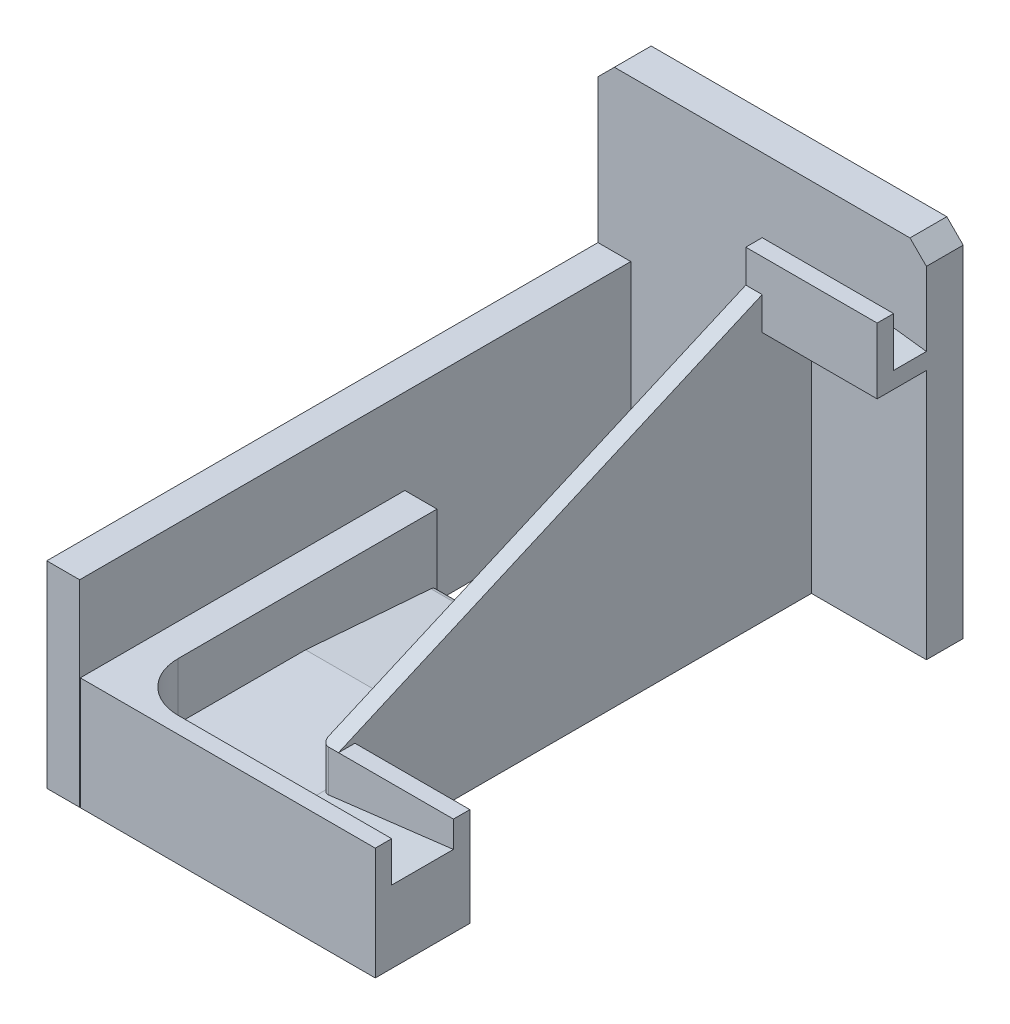
ISO-10303-21;
HEADER;
FILE_DESCRIPTION(('STEP AP214'),'2;1');
FILE_NAME('part.step','',(''),(''),'','','');
FILE_SCHEMA(('AUTOMOTIVE_DESIGN { 1 0 10303 214 1 1 1 1 }'));
ENDSEC;
DATA;
#1=APPLICATION_CONTEXT('core data for automotive mechanical design processes');
#2=APPLICATION_PROTOCOL_DEFINITION('international standard','automotive_design',2000,#1);
#3=PRODUCT_CONTEXT('',#1,'mechanical');
#4=PRODUCT('Part','Part','',(#3));
#5=PRODUCT_RELATED_PRODUCT_CATEGORY('part','',(#4));
#6=PRODUCT_DEFINITION_FORMATION('','',#4);
#7=PRODUCT_DEFINITION_CONTEXT('part definition',#1,'design');
#8=PRODUCT_DEFINITION('design','',#6,#7);
#9=PRODUCT_DEFINITION_SHAPE('','',#8);
#10=(LENGTH_UNIT() NAMED_UNIT(*) SI_UNIT(.MILLI.,.METRE.));
#11=(NAMED_UNIT(*) PLANE_ANGLE_UNIT() SI_UNIT($,.RADIAN.));
#12=(NAMED_UNIT(*) SI_UNIT($,.STERADIAN.) SOLID_ANGLE_UNIT());
#13=UNCERTAINTY_MEASURE_WITH_UNIT(LENGTH_MEASURE(1.E-05),#10,'distance_accuracy_value','');
#14=(GEOMETRIC_REPRESENTATION_CONTEXT(3) GLOBAL_UNCERTAINTY_ASSIGNED_CONTEXT((#13)) GLOBAL_UNIT_ASSIGNED_CONTEXT((#10,
#11,#12)) REPRESENTATION_CONTEXT('',''));
#15=CARTESIAN_POINT('',(0.,0.,0.));
#16=DIRECTION('',(0.,0.,1.));
#17=DIRECTION('',(1.,0.,0.));
#18=AXIS2_PLACEMENT_3D('',#15,#16,#17);
#19=CARTESIAN_POINT('',(20.,0.,0.));
#20=DIRECTION('',(1.,0.,0.));
#21=DIRECTION('',(0.,0.,-1.));
#22=AXIS2_PLACEMENT_3D('',#19,#20,#21);
#23=PLANE('',#22);
#24=DIRECTION('',(0.,0.,-1.));
#25=VECTOR('',#24,1.);
#26=CARTESIAN_POINT('',(20.,34.24,80.2));
#27=LINE('',#26,#25);
#28=CARTESIAN_POINT('',(20.,34.24,159.));
#29=VERTEX_POINT('',#28);
#30=CARTESIAN_POINT('',(20.,34.24,80.2));
#31=VERTEX_POINT('',#30);
#32=EDGE_CURVE('E269',#29,#31,#27,.T.);
#33=ORIENTED_EDGE('',*,*,#32,.F.);
#34=DIRECTION('',(0.,-1.,0.));
#35=VECTOR('',#34,1.);
#36=CARTESIAN_POINT('',(20.,55.4532034355965,159.));
#37=LINE('',#36,#35);
#38=CARTESIAN_POINT('',(20.,17.12,159.));
#39=VERTEX_POINT('',#38);
#40=EDGE_CURVE('E267',#29,#39,#37,.T.);
#41=ORIENTED_EDGE('',*,*,#40,.T.);
#42=DIRECTION('',(0.,0.,1.));
#43=VECTOR('',#42,1.);
#44=CARTESIAN_POINT('',(20.,17.12,120.2));
#45=LINE('',#44,#43);
#46=CARTESIAN_POINT('',(20.,17.12,120.2));
#47=VERTEX_POINT('',#46);
#48=EDGE_CURVE('E254',#47,#39,#45,.T.);
#49=ORIENTED_EDGE('',*,*,#48,.F.);
#50=DIRECTION('',(0.,0.0777638012302107,0.996971810643725));
#51=VECTOR('',#50,1.);
#52=CARTESIAN_POINT('',(20.,14.,80.2));
#53=LINE('',#52,#51);
#54=CARTESIAN_POINT('',(20.,14.1438688470081,82.0444723975396));
#55=VERTEX_POINT('',#54);
#56=EDGE_CURVE('E450',#55,#47,#53,.T.);
#57=ORIENTED_EDGE('',*,*,#56,.F.);
#58=CARTESIAN_POINT('',(20.,12.1499252257206,82.2));
#59=DIRECTION('',(1.,0.,0.));
#60=DIRECTION('',(0.,0.,-1.));
#61=AXIS2_PLACEMENT_3D('',#58,#59,#60);
#62=CIRCLE('',#61,2.);
#63=CARTESIAN_POINT('',(20.,12.1499252257206,80.2));
#64=VERTEX_POINT('',#63);
#65=EDGE_CURVE('E504',#55,#64,#62,.F.);
#66=ORIENTED_EDGE('',*,*,#65,.T.);
#67=DIRECTION('',(0.,-1.,0.));
#68=VECTOR('',#67,1.);
#69=CARTESIAN_POINT('',(20.,0.,80.2));
#70=LINE('',#69,#68);
#71=EDGE_CURVE('E477',#31,#64,#70,.T.);
#72=ORIENTED_EDGE('',*,*,#71,.F.);
#73=EDGE_LOOP('',(#33,#41,#49,#57,#66,#72));
#74=FACE_BOUND('',#73,.T.);
#75=ADVANCED_FACE('F37',(#74),#23,.T.);
#76=CARTESIAN_POINT('',(155.34953801671,17.12,120.2));
#77=DIRECTION('',(0.,-1.,0.));
#78=DIRECTION('',(0.,0.,-1.));
#79=AXIS2_PLACEMENT_3D('',#76,#77,#78);
#80=PLANE('',#79);
#81=CARTESIAN_POINT('',(35.,17.12,159.));
#82=DIRECTION('',(0.,-1.,0.));
#83=DIRECTION('',(0.,0.,1.));
#84=AXIS2_PLACEMENT_3D('',#81,#82,#83);
#85=CIRCLE('',#84,15.);
#86=CARTESIAN_POINT('',(35.0000000000002,17.12,174.));
#87=VERTEX_POINT('',#86);
#88=EDGE_CURVE('E258',#87,#39,#85,.T.);
#89=ORIENTED_EDGE('',*,*,#88,.F.);
#90=DIRECTION('',(-1.,0.,0.));
#91=VECTOR('',#90,1.);
#92=CARTESIAN_POINT('',(155.34953801671,17.12,174.));
#93=LINE('',#92,#91);
#94=CARTESIAN_POINT('',(60.,17.12,174.));
#95=VERTEX_POINT('',#94);
#96=EDGE_CURVE('E264',#95,#87,#93,.T.);
#97=ORIENTED_EDGE('',*,*,#96,.F.);
#98=DIRECTION('',(0.,0.,1.));
#99=VECTOR('',#98,1.);
#100=CARTESIAN_POINT('',(60.,17.12,120.2));
#101=LINE('',#100,#99);
#102=CARTESIAN_POINT('',(60.,17.12,153.200000000027));
#103=VERTEX_POINT('',#102);
#104=EDGE_CURVE('E52',#103,#95,#101,.T.);
#105=ORIENTED_EDGE('',*,*,#104,.F.);
#106=CARTESIAN_POINT('',(60.0000000000001,17.12,120.2));
#107=VERTEX_POINT('',#106);
#108=EDGE_CURVE('E453',#107,#103,#101,.T.);
#109=ORIENTED_EDGE('',*,*,#108,.F.);
#110=DIRECTION('',(-1.,0.,0.));
#111=VECTOR('',#110,1.);
#112=CARTESIAN_POINT('',(155.34953801671,17.12,120.2));
#113=LINE('',#112,#111);
#114=EDGE_CURVE('E261',#107,#47,#113,.T.);
#115=ORIENTED_EDGE('',*,*,#114,.T.);
#116=ORIENTED_EDGE('',*,*,#48,.T.);
#117=EDGE_LOOP('',(#89,#97,#105,#109,#115,#116));
#118=FACE_BOUND('',#117,.T.);
#119=ADVANCED_FACE('F256',(#118),#80,.F.);
#120=CARTESIAN_POINT('',(0.,0.,11.2));
#121=DIRECTION('',(0.,0.,-1.));
#122=DIRECTION('',(-1.,0.,0.));
#123=AXIS2_PLACEMENT_3D('',#120,#121,#122);
#124=PLANE('',#123);
#125=DIRECTION('',(0.,1.,0.));
#126=VECTOR('',#125,1.);
#127=CARTESIAN_POINT('',(10.,0.,11.2));
#128=LINE('',#127,#126);
#129=CARTESIAN_POINT('',(10.,0.,11.2));
#130=VERTEX_POINT('',#129);
#131=CARTESIAN_POINT('',(10.,60.,11.2));
#132=VERTEX_POINT('',#131);
#133=EDGE_CURVE('E288',#130,#132,#128,.T.);
#134=ORIENTED_EDGE('',*,*,#133,.F.);
#135=DIRECTION('',(1.,0.,0.));
#136=VECTOR('',#135,1.);
#137=CARTESIAN_POINT('',(0.,0.,11.2));
#138=LINE('',#137,#136);
#139=CARTESIAN_POINT('',(60.,0.,11.2));
#140=VERTEX_POINT('',#139);
#141=EDGE_CURVE('E410',#130,#140,#138,.T.);
#142=ORIENTED_EDGE('',*,*,#141,.T.);
#143=DIRECTION('',(0.,1.,0.));
#144=VECTOR('',#143,1.);
#145=CARTESIAN_POINT('',(60.,86.29,11.1999999999739));
#146=LINE('',#145,#144);
#147=CARTESIAN_POINT('',(60.,86.29,11.1999999999739));
#148=VERTEX_POINT('',#147);
#149=EDGE_CURVE('E394',#140,#148,#146,.T.);
#150=ORIENTED_EDGE('',*,*,#149,.T.);
#151=DIRECTION('',(0.992277876713668,-0.124034734589208,0.));
#152=VECTOR('',#151,1.);
#153=CARTESIAN_POINT('',(60.,86.29,11.1999999999739));
#154=LINE('',#153,#152);
#155=CARTESIAN_POINT('',(100.,81.29,11.1999999999739));
#156=VERTEX_POINT('',#155);
#157=EDGE_CURVE('E401',#148,#156,#154,.T.);
#158=ORIENTED_EDGE('',*,*,#157,.T.);
#159=DIRECTION('',(0.,1.,0.));
#160=VECTOR('',#159,1.);
#161=CARTESIAN_POINT('',(100.,0.,11.2));
#162=LINE('',#161,#160);
#163=CARTESIAN_POINT('',(100.,103.73,11.2));
#164=VERTEX_POINT('',#163);
#165=EDGE_CURVE('E412',#156,#164,#162,.T.);
#166=ORIENTED_EDGE('',*,*,#165,.T.);
#167=DIRECTION('',(-0.707106781186547,0.707106781186547,0.));
#168=VECTOR('',#167,1.);
#169=CARTESIAN_POINT('',(95.,108.73,11.2));
#170=LINE('',#169,#168);
#171=CARTESIAN_POINT('',(95.,108.73,11.2));
#172=VERTEX_POINT('',#171);
#173=EDGE_CURVE('E416',#164,#172,#170,.T.);
#174=ORIENTED_EDGE('',*,*,#173,.T.);
#175=DIRECTION('',(-1.,0.,0.));
#176=VECTOR('',#175,1.);
#177=CARTESIAN_POINT('',(5.,108.73,11.2));
#178=LINE('',#177,#176);
#179=CARTESIAN_POINT('',(5.,108.73,11.2));
#180=VERTEX_POINT('',#179);
#181=EDGE_CURVE('E418',#172,#180,#178,.T.);
#182=ORIENTED_EDGE('',*,*,#181,.T.);
#183=DIRECTION('',(-0.707106781186547,-0.707106781186548,0.));
#184=VECTOR('',#183,1.);
#185=CARTESIAN_POINT('',(0.,103.73,11.2));
#186=LINE('',#185,#184);
#187=CARTESIAN_POINT('',(0.,103.73,11.2));
#188=VERTEX_POINT('',#187);
#189=EDGE_CURVE('E420',#180,#188,#186,.T.);
#190=ORIENTED_EDGE('',*,*,#189,.T.);
#191=DIRECTION('',(0.,-1.,0.));
#192=VECTOR('',#191,1.);
#193=CARTESIAN_POINT('',(0.,0.,11.2));
#194=LINE('',#193,#192);
#195=CARTESIAN_POINT('',(0.,60.,11.2));
#196=VERTEX_POINT('',#195);
#197=EDGE_CURVE('E406',#188,#196,#194,.T.);
#198=ORIENTED_EDGE('',*,*,#197,.T.);
#199=DIRECTION('',(-1.,0.,0.));
#200=VECTOR('',#199,1.);
#201=CARTESIAN_POINT('',(0.,60.,11.2));
#202=LINE('',#201,#200);
#203=EDGE_CURVE('E283',#132,#196,#202,.T.);
#204=ORIENTED_EDGE('',*,*,#203,.F.);
#205=EDGE_LOOP('',(#134,#142,#150,#158,#166,#174,#182,#190,#198,#204));
#206=FACE_BOUND('',#205,.T.);
#207=ADVANCED_FACE('F594',(#206),#124,.F.);
#208=CARTESIAN_POINT('',(0.,0.,174.));
#209=DIRECTION('',(0.,0.,-1.));
#210=DIRECTION('',(-1.,0.,0.));
#211=AXIS2_PLACEMENT_3D('',#208,#209,#210);
#212=PLANE('',#211);
#213=DIRECTION('',(0.,-1.,0.));
#214=VECTOR('',#213,1.);
#215=CARTESIAN_POINT('',(35.0000000000002,55.4532034355965,174.));
#216=LINE('',#215,#214);
#217=CARTESIAN_POINT('',(35.0000000000002,34.24,174.));
#218=VERTEX_POINT('',#217);
#219=EDGE_CURVE('E277',#218,#87,#216,.T.);
#220=ORIENTED_EDGE('',*,*,#219,.F.);
#221=DIRECTION('',(-1.,0.,0.));
#222=VECTOR('',#221,1.);
#223=CARTESIAN_POINT('',(20.,34.24,174.));
#224=LINE('',#223,#222);
#225=CARTESIAN_POINT('',(100.,34.24,174.));
#226=VERTEX_POINT('',#225);
#227=EDGE_CURVE('E465',#226,#218,#224,.T.);
#228=ORIENTED_EDGE('',*,*,#227,.F.);
#229=DIRECTION('',(0.,1.,0.));
#230=VECTOR('',#229,1.);
#231=CARTESIAN_POINT('',(100.,0.,174.));
#232=LINE('',#231,#230);
#233=CARTESIAN_POINT('',(100.,22.,174.));
#234=VERTEX_POINT('',#233);
#235=EDGE_CURVE('E463',#234,#226,#232,.T.);
#236=ORIENTED_EDGE('',*,*,#235,.F.);
#237=DIRECTION('',(0.992640057880682,0.121102087061444,0.));
#238=VECTOR('',#237,1.);
#239=CARTESIAN_POINT('',(60.,17.12,173.999999999978));
#240=LINE('',#239,#238);
#241=EDGE_CURVE('E314',#95,#234,#240,.T.);
#242=ORIENTED_EDGE('',*,*,#241,.F.);
#243=ORIENTED_EDGE('',*,*,#96,.T.);
#244=EDGE_LOOP('',(#220,#228,#236,#242,#243));
#245=FACE_BOUND('',#244,.T.);
#246=ADVANCED_FACE('F576',(#245),#212,.T.);
#247=CARTESIAN_POINT('',(65.,30.,155.2));
#248=DIRECTION('',(0.,0.,1.));
#249=DIRECTION('',(1.,0.,0.));
#250=AXIS2_PLACEMENT_3D('',#247,#248,#249);
#251=PLANE('',#250);
#252=DIRECTION('',(-1.,0.,0.));
#253=VECTOR('',#252,1.);
#254=CARTESIAN_POINT('',(65.,30.,155.2));
#255=LINE('',#254,#253);
#256=CARTESIAN_POINT('',(65.,30.,155.2));
#257=VERTEX_POINT('',#256);
#258=CARTESIAN_POINT('',(62.,30.,155.2));
#259=VERTEX_POINT('',#258);
#260=EDGE_CURVE('E353',#257,#259,#255,.T.);
#261=ORIENTED_EDGE('',*,*,#260,.T.);
#262=DIRECTION('',(0.,1.,0.));
#263=VECTOR('',#262,1.);
#264=CARTESIAN_POINT('',(62.,17.12,155.2));
#265=LINE('',#264,#263);
#266=CARTESIAN_POINT('',(62.,17.364,155.2));
#267=VERTEX_POINT('',#266);
#268=EDGE_CURVE('E45',#259,#267,#265,.F.);
#269=ORIENTED_EDGE('',*,*,#268,.T.);
#270=DIRECTION('',(-0.992640057880681,-0.121102087061444,0.));
#271=VECTOR('',#270,1.);
#272=CARTESIAN_POINT('',(60.,17.12,155.2));
#273=LINE('',#272,#271);
#274=CARTESIAN_POINT('',(100.,22.,155.2));
#275=VERTEX_POINT('',#274);
#276=EDGE_CURVE('E295',#275,#267,#273,.T.);
#277=ORIENTED_EDGE('',*,*,#276,.F.);
#278=DIRECTION('',(0.,1.,0.));
#279=VECTOR('',#278,1.);
#280=CARTESIAN_POINT('',(100.,0.,155.2));
#281=LINE('',#280,#279);
#282=CARTESIAN_POINT('',(100.,30.,155.2));
#283=VERTEX_POINT('',#282);
#284=EDGE_CURVE('E317',#275,#283,#281,.T.);
#285=ORIENTED_EDGE('',*,*,#284,.T.);
#286=DIRECTION('',(-1.,0.,0.));
#287=VECTOR('',#286,1.);
#288=CARTESIAN_POINT('',(65.,30.,155.2));
#289=LINE('',#288,#287);
#290=EDGE_CURVE('E322',#283,#257,#289,.T.);
#291=ORIENTED_EDGE('',*,*,#290,.T.);
#292=EDGE_LOOP('',(#261,#269,#277,#285,#291));
#293=FACE_BOUND('',#292,.T.);
#294=ADVANCED_FACE('F520',(#293),#251,.T.);
#295=CARTESIAN_POINT('',(20.,0.,80.2));
#296=DIRECTION('',(0.,0.,-1.));
#297=DIRECTION('',(-1.,0.,0.));
#298=AXIS2_PLACEMENT_3D('',#295,#296,#297);
#299=PLANE('',#298);
#300=ORIENTED_EDGE('',*,*,#71,.T.);
#301=DIRECTION('',(-1.,0.,0.));
#302=VECTOR('',#301,1.);
#303=CARTESIAN_POINT('',(60.0000000000001,12.1499252257206,80.2));
#304=LINE('',#303,#302);
#305=CARTESIAN_POINT('',(60.,12.1499252257206,80.2));
#306=VERTEX_POINT('',#305);
#307=EDGE_CURVE('E502',#64,#306,#304,.F.);
#308=ORIENTED_EDGE('',*,*,#307,.T.);
#309=DIRECTION('',(0.,1.,0.));
#310=VECTOR('',#309,1.);
#311=CARTESIAN_POINT('',(60.,0.,80.2));
#312=LINE('',#311,#310);
#313=CARTESIAN_POINT('',(60.0000000000001,0.,80.2));
#314=VERTEX_POINT('',#313);
#315=EDGE_CURVE('E458',#314,#306,#312,.T.);
#316=ORIENTED_EDGE('',*,*,#315,.F.);
#317=DIRECTION('',(-1.,0.,0.));
#318=VECTOR('',#317,1.);
#319=CARTESIAN_POINT('',(20.,0.,80.2));
#320=LINE('',#319,#318);
#321=CARTESIAN_POINT('',(10.2,0.,80.2));
#322=VERTEX_POINT('',#321);
#323=EDGE_CURVE('E481',#314,#322,#320,.T.);
#324=ORIENTED_EDGE('',*,*,#323,.T.);
#325=DIRECTION('',(0.,-1.,0.));
#326=VECTOR('',#325,1.);
#327=CARTESIAN_POINT('',(10.2,0.,80.2));
#328=LINE('',#327,#326);
#329=CARTESIAN_POINT('',(10.2,34.24,80.2));
#330=VERTEX_POINT('',#329);
#331=EDGE_CURVE('E474',#330,#322,#328,.T.);
#332=ORIENTED_EDGE('',*,*,#331,.F.);
#333=DIRECTION('',(-1.,0.,0.));
#334=VECTOR('',#333,1.);
#335=CARTESIAN_POINT('',(20.,34.24,80.2));
#336=LINE('',#335,#334);
#337=EDGE_CURVE('E492',#31,#330,#336,.T.);
#338=ORIENTED_EDGE('',*,*,#337,.F.);
#339=EDGE_LOOP('',(#300,#308,#316,#324,#332,#338));
#340=FACE_BOUND('',#339,.T.);
#341=ADVANCED_FACE('F557',(#340),#299,.T.);
#342=CARTESIAN_POINT('',(20.,34.24,80.2));
#343=DIRECTION('',(0.,1.,0.));
#344=DIRECTION('',(0.,0.,1.));
#345=AXIS2_PLACEMENT_3D('',#342,#343,#344);
#346=PLANE('',#345);
#347=CARTESIAN_POINT('',(35.,34.24,159.));
#348=DIRECTION('',(0.,1.,0.));
#349=DIRECTION('',(0.,0.,1.));
#350=AXIS2_PLACEMENT_3D('',#347,#348,#349);
#351=CIRCLE('',#350,15.);
#352=EDGE_CURVE('E273',#218,#29,#351,.F.);
#353=ORIENTED_EDGE('',*,*,#352,.T.);
#354=ORIENTED_EDGE('',*,*,#32,.T.);
#355=ORIENTED_EDGE('',*,*,#337,.T.);
#356=DIRECTION('',(0.,0.,-1.));
#357=VECTOR('',#356,1.);
#358=CARTESIAN_POINT('',(10.2,34.24,80.2));
#359=LINE('',#358,#357);
#360=CARTESIAN_POINT('',(10.2,34.24,179.));
#361=VERTEX_POINT('',#360);
#362=EDGE_CURVE('E479',#361,#330,#359,.T.);
#363=ORIENTED_EDGE('',*,*,#362,.F.);
#364=DIRECTION('',(-1.,0.,0.));
#365=VECTOR('',#364,1.);
#366=CARTESIAN_POINT('',(20.,34.24,179.));
#367=LINE('',#366,#365);
#368=CARTESIAN_POINT('',(100.,34.24,179.));
#369=VERTEX_POINT('',#368);
#370=EDGE_CURVE('E495',#369,#361,#367,.T.);
#371=ORIENTED_EDGE('',*,*,#370,.F.);
#372=DIRECTION('',(0.,0.,1.));
#373=VECTOR('',#372,1.);
#374=CARTESIAN_POINT('',(100.,34.24,174.));
#375=LINE('',#374,#373);
#376=EDGE_CURVE('E471',#226,#369,#375,.T.);
#377=ORIENTED_EDGE('',*,*,#376,.F.);
#378=ORIENTED_EDGE('',*,*,#227,.T.);
#379=EDGE_LOOP('',(#353,#354,#355,#363,#371,#377,#378));
#380=FACE_BOUND('',#379,.T.);
#381=ADVANCED_FACE('F572',(#380),#346,.T.);
#382=CARTESIAN_POINT('',(20.,0.,179.));
#383=DIRECTION('',(0.,0.,1.));
#384=DIRECTION('',(1.,0.,0.));
#385=AXIS2_PLACEMENT_3D('',#382,#383,#384);
#386=PLANE('',#385);
#387=DIRECTION('',(0.,1.,0.));
#388=VECTOR('',#387,1.);
#389=CARTESIAN_POINT('',(10.2,0.,179.));
#390=LINE('',#389,#388);
#391=CARTESIAN_POINT('',(10.2,0.,179.));
#392=VERTEX_POINT('',#391);
#393=EDGE_CURVE('E487',#392,#361,#390,.T.);
#394=ORIENTED_EDGE('',*,*,#393,.F.);
#395=DIRECTION('',(-1.,0.,0.));
#396=VECTOR('',#395,1.);
#397=CARTESIAN_POINT('',(20.,0.,179.));
#398=LINE('',#397,#396);
#399=CARTESIAN_POINT('',(100.,0.,179.));
#400=VERTEX_POINT('',#399);
#401=EDGE_CURVE('E497',#400,#392,#398,.T.);
#402=ORIENTED_EDGE('',*,*,#401,.F.);
#403=DIRECTION('',(0.,1.,0.));
#404=VECTOR('',#403,1.);
#405=CARTESIAN_POINT('',(100.,0.,179.));
#406=LINE('',#405,#404);
#407=EDGE_CURVE('E455',#400,#369,#406,.T.);
#408=ORIENTED_EDGE('',*,*,#407,.T.);
#409=ORIENTED_EDGE('',*,*,#370,.T.);
#410=EDGE_LOOP('',(#394,#402,#408,#409));
#411=FACE_BOUND('',#410,.T.);
#412=ADVANCED_FACE('F578',(#411),#386,.T.);
#413=CARTESIAN_POINT('',(20.,0.,80.2));
#414=DIRECTION('',(0.,-1.,0.));
#415=DIRECTION('',(0.,0.,-1.));
#416=AXIS2_PLACEMENT_3D('',#413,#414,#415);
#417=PLANE('',#416);
#418=DIRECTION('',(1.,0.,0.));
#419=VECTOR('',#418,1.);
#420=CARTESIAN_POINT('',(65.,0.,150.2));
#421=LINE('',#420,#419);
#422=CARTESIAN_POINT('',(65.,0.,150.2));
#423=VERTEX_POINT('',#422);
#424=CARTESIAN_POINT('',(100.,0.,150.2));
#425=VERTEX_POINT('',#424);
#426=EDGE_CURVE('E321',#423,#425,#421,.T.);
#427=ORIENTED_EDGE('',*,*,#426,.T.);
#428=DIRECTION('',(0.,0.,1.));
#429=VECTOR('',#428,1.);
#430=CARTESIAN_POINT('',(100.,0.,174.));
#431=LINE('',#430,#429);
#432=EDGE_CURVE('E468',#425,#400,#431,.T.);
#433=ORIENTED_EDGE('',*,*,#432,.T.);
#434=ORIENTED_EDGE('',*,*,#401,.T.);
#435=DIRECTION('',(0.,0.,1.));
#436=VECTOR('',#435,1.);
#437=CARTESIAN_POINT('',(10.2,0.,80.2));
#438=LINE('',#437,#436);
#439=EDGE_CURVE('E484',#322,#392,#438,.T.);
#440=ORIENTED_EDGE('',*,*,#439,.F.);
#441=ORIENTED_EDGE('',*,*,#323,.F.);
#442=DIRECTION('',(0.,0.,1.));
#443=VECTOR('',#442,1.);
#444=CARTESIAN_POINT('',(60.,0.,155.2));
#445=LINE('',#444,#443);
#446=EDGE_CURVE('E337',#140,#314,#445,.T.);
#447=ORIENTED_EDGE('',*,*,#446,.F.);
#448=ORIENTED_EDGE('',*,*,#141,.F.);
#449=DIRECTION('',(0.,0.,-1.));
#450=VECTOR('',#449,1.);
#451=CARTESIAN_POINT('',(10.,0.,239.827625302982));
#452=LINE('',#451,#450);
#453=CARTESIAN_POINT('',(10.,0.,179.));
#454=VERTEX_POINT('',#453);
#455=EDGE_CURVE('E291',#454,#130,#452,.T.);
#456=ORIENTED_EDGE('',*,*,#455,.F.);
#457=DIRECTION('',(1.,0.,0.));
#458=VECTOR('',#457,1.);
#459=CARTESIAN_POINT('',(0.,0.,179.));
#460=LINE('',#459,#458);
#461=CARTESIAN_POINT('',(0.,0.,179.));
#462=VERTEX_POINT('',#461);
#463=EDGE_CURVE('E296',#462,#454,#460,.T.);
#464=ORIENTED_EDGE('',*,*,#463,.F.);
#465=DIRECTION('',(0.,0.,-1.));
#466=VECTOR('',#465,1.);
#467=CARTESIAN_POINT('',(0.,0.,11.2));
#468=LINE('',#467,#466);
#469=CARTESIAN_POINT('',(0.,0.,0.));
#470=VERTEX_POINT('',#469);
#471=EDGE_CURVE('E448',#462,#470,#468,.T.);
#472=ORIENTED_EDGE('',*,*,#471,.T.);
#473=DIRECTION('',(1.,0.,0.));
#474=VECTOR('',#473,1.);
#475=CARTESIAN_POINT('',(0.,0.,0.));
#476=LINE('',#475,#474);
#477=CARTESIAN_POINT('',(100.,0.,0.));
#478=VERTEX_POINT('',#477);
#479=EDGE_CURVE('E425',#470,#478,#476,.T.);
#480=ORIENTED_EDGE('',*,*,#479,.T.);
#481=DIRECTION('',(0.,0.,-1.));
#482=VECTOR('',#481,1.);
#483=CARTESIAN_POINT('',(100.,0.,11.2));
#484=LINE('',#483,#482);
#485=CARTESIAN_POINT('',(100.,0.,11.2));
#486=VERTEX_POINT('',#485);
#487=EDGE_CURVE('E445',#486,#478,#484,.T.);
#488=ORIENTED_EDGE('',*,*,#487,.F.);
#489=CARTESIAN_POINT('',(65.,0.,11.2));
#490=VERTEX_POINT('',#489);
#491=EDGE_CURVE('E408',#490,#486,#138,.T.);
#492=ORIENTED_EDGE('',*,*,#491,.F.);
#493=DIRECTION('',(0.,0.,1.));
#494=VECTOR('',#493,1.);
#495=CARTESIAN_POINT('',(65.,0.,11.2));
#496=LINE('',#495,#494);
#497=EDGE_CURVE('E347',#490,#423,#496,.T.);
#498=ORIENTED_EDGE('',*,*,#497,.T.);
#499=EDGE_LOOP('',(#427,#433,#434,#440,#441,#447,#448,#456,#464,#472,#480,#488,#492,#498));
#500=FACE_BOUND('',#499,.T.);
#501=ADVANCED_FACE('F563',(#500),#417,.T.);
#502=CARTESIAN_POINT('',(10.2,0.,0.));
#503=DIRECTION('',(1.,0.,0.));
#504=DIRECTION('',(0.,0.,-1.));
#505=AXIS2_PLACEMENT_3D('',#502,#503,#504);
#506=PLANE('',#505);
#507=ORIENTED_EDGE('',*,*,#331,.T.);
#508=ORIENTED_EDGE('',*,*,#439,.T.);
#509=ORIENTED_EDGE('',*,*,#393,.T.);
#510=ORIENTED_EDGE('',*,*,#362,.T.);
#511=EDGE_LOOP('',(#507,#508,#509,#510));
#512=FACE_BOUND('',#511,.T.);
#513=ADVANCED_FACE('F569',(#512),#506,.F.);
#514=CARTESIAN_POINT('',(100.,0.,174.));
#515=DIRECTION('',(1.,0.,0.));
#516=DIRECTION('',(0.,0.,-1.));
#517=AXIS2_PLACEMENT_3D('',#514,#515,#516);
#518=PLANE('',#517);
#519=ORIENTED_EDGE('',*,*,#407,.F.);
#520=ORIENTED_EDGE('',*,*,#432,.F.);
#521=DIRECTION('',(0.,1.,0.));
#522=VECTOR('',#521,1.);
#523=CARTESIAN_POINT('',(100.,0.,150.2));
#524=LINE('',#523,#522);
#525=CARTESIAN_POINT('',(100.,30.,150.2));
#526=VERTEX_POINT('',#525);
#527=EDGE_CURVE('E325',#425,#526,#524,.T.);
#528=ORIENTED_EDGE('',*,*,#527,.T.);
#529=DIRECTION('',(0.,0.,1.));
#530=VECTOR('',#529,1.);
#531=CARTESIAN_POINT('',(100.,30.,150.2));
#532=LINE('',#531,#530);
#533=EDGE_CURVE('E331',#526,#283,#532,.T.);
#534=ORIENTED_EDGE('',*,*,#533,.T.);
#535=ORIENTED_EDGE('',*,*,#284,.F.);
#536=DIRECTION('',(0.,0.,-1.));
#537=VECTOR('',#536,1.);
#538=CARTESIAN_POINT('',(100.,22.,500000.));
#539=LINE('',#538,#537);
#540=EDGE_CURVE('E311',#234,#275,#539,.T.);
#541=ORIENTED_EDGE('',*,*,#540,.F.);
#542=ORIENTED_EDGE('',*,*,#235,.T.);
#543=ORIENTED_EDGE('',*,*,#376,.T.);
#544=EDGE_LOOP('',(#519,#520,#528,#534,#535,#541,#542,#543));
#545=FACE_BOUND('',#544,.T.);
#546=ADVANCED_FACE('F528',(#545),#518,.T.);
#547=CARTESIAN_POINT('',(155.34953801671,14.,80.2));
#548=DIRECTION('',(0.,-0.996971810643725,0.0777638012302107));
#549=DIRECTION('',(0.,-0.0777638012302107,-0.996971810643726));
#550=AXIS2_PLACEMENT_3D('',#547,#548,#549);
#551=PLANE('',#550);
#552=DIRECTION('',(0.,0.0777638012302107,0.996971810643726));
#553=VECTOR('',#552,1.);
#554=CARTESIAN_POINT('',(60.,14.,80.2));
#555=LINE('',#554,#553);
#556=CARTESIAN_POINT('',(60.,14.1438688470081,82.0444723975396));
#557=VERTEX_POINT('',#556);
#558=EDGE_CURVE('E456',#557,#107,#555,.T.);
#559=ORIENTED_EDGE('',*,*,#558,.F.);
#560=DIRECTION('',(-1.,0.,0.));
#561=VECTOR('',#560,1.);
#562=CARTESIAN_POINT('',(20.,14.1438688470081,82.0444723975396));
#563=LINE('',#562,#561);
#564=EDGE_CURVE('E494',#557,#55,#563,.T.);
#565=ORIENTED_EDGE('',*,*,#564,.T.);
#566=ORIENTED_EDGE('',*,*,#56,.T.);
#567=ORIENTED_EDGE('',*,*,#114,.F.);
#568=EDGE_LOOP('',(#559,#565,#566,#567));
#569=FACE_BOUND('',#568,.T.);
#570=ADVANCED_FACE('F549',(#569),#551,.F.);
#571=DIRECTION('',(0.,-1.,3.42146862537987E-13));
#572=VECTOR('',#571,1.);
#573=CARTESIAN_POINT('',(65.,76.29,11.1999999999739));
#574=LINE('',#573,#572);
#575=CARTESIAN_POINT('',(65.,76.29,11.1999999999739));
#576=VERTEX_POINT('',#575);
#577=EDGE_CURVE('E345',#576,#490,#574,.T.);
#578=ORIENTED_EDGE('',*,*,#577,.T.);
#579=ORIENTED_EDGE('',*,*,#491,.T.);
#580=CARTESIAN_POINT('',(100.,76.29,11.2000000000307));
#581=VERTEX_POINT('',#580);
#582=EDGE_CURVE('E413',#486,#581,#162,.T.);
#583=ORIENTED_EDGE('',*,*,#582,.T.);
#584=DIRECTION('',(-1.,0.,0.));
#585=VECTOR('',#584,1.);
#586=CARTESIAN_POINT('',(60.,76.29,11.1999999999739));
#587=LINE('',#586,#585);
#588=EDGE_CURVE('E384',#581,#576,#587,.T.);
#589=ORIENTED_EDGE('',*,*,#588,.T.);
#590=EDGE_LOOP('',(#578,#579,#583,#589));
#591=FACE_BOUND('',#590,.T.);
#592=ADVANCED_FACE('F639',(#591),#124,.F.);
#593=CARTESIAN_POINT('',(60.,76.29,-500000.));
#594=DIRECTION('',(0.,1.,0.));
#595=DIRECTION('',(0.,0.,1.));
#596=AXIS2_PLACEMENT_3D('',#593,#594,#595);
#597=PLANE('',#596);
#598=DIRECTION('',(0.,0.,-1.));
#599=VECTOR('',#598,1.);
#600=CARTESIAN_POINT('',(65.,76.29,26.2));
#601=LINE('',#600,#599);
#602=CARTESIAN_POINT('',(65.,76.29,26.2));
#603=VERTEX_POINT('',#602);
#604=EDGE_CURVE('E342',#603,#576,#601,.T.);
#605=ORIENTED_EDGE('',*,*,#604,.T.);
#606=ORIENTED_EDGE('',*,*,#588,.F.);
#607=DIRECTION('',(0.,0.,1.));
#608=VECTOR('',#607,1.);
#609=CARTESIAN_POINT('',(100.,76.29,-500000.));
#610=LINE('',#609,#608);
#611=CARTESIAN_POINT('',(100.,76.29,26.2));
#612=VERTEX_POINT('',#611);
#613=EDGE_CURVE('E389',#581,#612,#610,.T.);
#614=ORIENTED_EDGE('',*,*,#613,.T.);
#615=DIRECTION('',(1.,0.,0.));
#616=VECTOR('',#615,1.);
#617=CARTESIAN_POINT('',(100.,76.29,26.2));
#618=LINE('',#617,#616);
#619=EDGE_CURVE('E371',#603,#612,#618,.T.);
#620=ORIENTED_EDGE('',*,*,#619,.F.);
#621=EDGE_LOOP('',(#605,#606,#614,#620));
#622=FACE_BOUND('',#621,.T.);
#623=ADVANCED_FACE('F635',(#622),#597,.F.);
#624=CARTESIAN_POINT('',(0.,0.,11.2));
#625=DIRECTION('',(1.,0.,0.));
#626=DIRECTION('',(0.,0.,-1.));
#627=AXIS2_PLACEMENT_3D('',#624,#625,#626);
#628=PLANE('',#627);
#629=DIRECTION('',(0.,-1.,0.));
#630=VECTOR('',#629,1.);
#631=CARTESIAN_POINT('',(0.,0.,0.));
#632=LINE('',#631,#630);
#633=CARTESIAN_POINT('',(0.,103.73,0.));
#634=VERTEX_POINT('',#633);
#635=EDGE_CURVE('E388',#634,#470,#632,.T.);
#636=ORIENTED_EDGE('',*,*,#635,.T.);
#637=ORIENTED_EDGE('',*,*,#471,.F.);
#638=DIRECTION('',(0.,-1.,0.));
#639=VECTOR('',#638,1.);
#640=CARTESIAN_POINT('',(0.,0.,179.));
#641=LINE('',#640,#639);
#642=CARTESIAN_POINT('',(0.,60.,179.));
#643=VERTEX_POINT('',#642);
#644=EDGE_CURVE('E299',#643,#462,#641,.T.);
#645=ORIENTED_EDGE('',*,*,#644,.F.);
#646=DIRECTION('',(0.,0.,-1.));
#647=VECTOR('',#646,1.);
#648=CARTESIAN_POINT('',(0.,60.,239.827625302982));
#649=LINE('',#648,#647);
#650=EDGE_CURVE('E281',#643,#196,#649,.T.);
#651=ORIENTED_EDGE('',*,*,#650,.T.);
#652=ORIENTED_EDGE('',*,*,#197,.F.);
#653=DIRECTION('',(0.,0.,-1.));
#654=VECTOR('',#653,1.);
#655=CARTESIAN_POINT('',(0.,103.73,11.2));
#656=LINE('',#655,#654);
#657=EDGE_CURVE('E422',#188,#634,#656,.T.);
#658=ORIENTED_EDGE('',*,*,#657,.T.);
#659=EDGE_LOOP('',(#636,#637,#645,#651,#652,#658));
#660=FACE_BOUND('',#659,.T.);
#661=ADVANCED_FACE('F638',(#660),#628,.F.);
#662=CARTESIAN_POINT('',(100.,0.,11.2));
#663=DIRECTION('',(-1.,0.,0.));
#664=DIRECTION('',(0.,0.,1.));
#665=AXIS2_PLACEMENT_3D('',#662,#663,#664);
#666=PLANE('',#665);
#667=DIRECTION('',(0.,1.,0.));
#668=VECTOR('',#667,1.);
#669=CARTESIAN_POINT('',(100.,0.,0.));
#670=LINE('',#669,#668);
#671=CARTESIAN_POINT('',(100.,103.73,0.));
#672=VERTEX_POINT('',#671);
#673=EDGE_CURVE('E427',#478,#672,#670,.T.);
#674=ORIENTED_EDGE('',*,*,#673,.T.);
#675=DIRECTION('',(0.,0.,-1.));
#676=VECTOR('',#675,1.);
#677=CARTESIAN_POINT('',(100.,103.73,11.2));
#678=LINE('',#677,#676);
#679=EDGE_CURVE('E442',#164,#672,#678,.T.);
#680=ORIENTED_EDGE('',*,*,#679,.F.);
#681=ORIENTED_EDGE('',*,*,#165,.F.);
#682=DIRECTION('',(0.,0.,1.));
#683=VECTOR('',#682,1.);
#684=CARTESIAN_POINT('',(100.,81.29,-500000.));
#685=LINE('',#684,#683);
#686=CARTESIAN_POINT('',(100.,81.29,21.2));
#687=VERTEX_POINT('',#686);
#688=EDGE_CURVE('E393',#156,#687,#685,.T.);
#689=ORIENTED_EDGE('',*,*,#688,.T.);
#690=DIRECTION('',(0.,1.,0.));
#691=VECTOR('',#690,1.);
#692=CARTESIAN_POINT('',(100.,76.29,21.2));
#693=LINE('',#692,#691);
#694=CARTESIAN_POINT('',(100.,96.29,21.2));
#695=VERTEX_POINT('',#694);
#696=EDGE_CURVE('E360',#687,#695,#693,.T.);
#697=ORIENTED_EDGE('',*,*,#696,.T.);
#698=DIRECTION('',(0.,0.,-1.));
#699=VECTOR('',#698,1.);
#700=CARTESIAN_POINT('',(100.,96.29,26.2));
#701=LINE('',#700,#699);
#702=CARTESIAN_POINT('',(100.,96.29,26.2));
#703=VERTEX_POINT('',#702);
#704=EDGE_CURVE('E381',#703,#695,#701,.T.);
#705=ORIENTED_EDGE('',*,*,#704,.F.);
#706=DIRECTION('',(0.,1.,0.));
#707=VECTOR('',#706,1.);
#708=CARTESIAN_POINT('',(100.,76.29,26.2));
#709=LINE('',#708,#707);
#710=EDGE_CURVE('E362',#612,#703,#709,.T.);
#711=ORIENTED_EDGE('',*,*,#710,.F.);
#712=ORIENTED_EDGE('',*,*,#613,.F.);
#713=ORIENTED_EDGE('',*,*,#582,.F.);
#714=ORIENTED_EDGE('',*,*,#487,.T.);
#715=EDGE_LOOP('',(#674,#680,#681,#689,#697,#705,#711,#712,#713,#714));
#716=FACE_BOUND('',#715,.T.);
#717=ADVANCED_FACE('F658',(#716),#666,.F.);
#718=CARTESIAN_POINT('',(95.,108.73,11.2));
#719=DIRECTION('',(-0.707106781186548,-0.707106781186548,0.));
#720=DIRECTION('',(0.707106781186548,-0.707106781186548,0.));
#721=AXIS2_PLACEMENT_3D('',#718,#719,#720);
#722=PLANE('',#721);
#723=DIRECTION('',(-0.707106781186547,0.707106781186547,0.));
#724=VECTOR('',#723,1.);
#725=CARTESIAN_POINT('',(95.,108.73,0.));
#726=LINE('',#725,#724);
#727=CARTESIAN_POINT('',(95.,108.73,0.));
#728=VERTEX_POINT('',#727);
#729=EDGE_CURVE('E429',#672,#728,#726,.T.);
#730=ORIENTED_EDGE('',*,*,#729,.T.);
#731=DIRECTION('',(0.,0.,-1.));
#732=VECTOR('',#731,1.);
#733=CARTESIAN_POINT('',(95.,108.73,11.2));
#734=LINE('',#733,#732);
#735=EDGE_CURVE('E439',#172,#728,#734,.T.);
#736=ORIENTED_EDGE('',*,*,#735,.F.);
#737=ORIENTED_EDGE('',*,*,#173,.F.);
#738=ORIENTED_EDGE('',*,*,#679,.T.);
#739=EDGE_LOOP('',(#730,#736,#737,#738));
#740=FACE_BOUND('',#739,.T.);
#741=ADVANCED_FACE('F654',(#740),#722,.F.);
#742=CARTESIAN_POINT('',(5.,108.73,11.2));
#743=DIRECTION('',(0.,-1.,0.));
#744=DIRECTION('',(0.,0.,-1.));
#745=AXIS2_PLACEMENT_3D('',#742,#743,#744);
#746=PLANE('',#745);
#747=DIRECTION('',(-1.,0.,0.));
#748=VECTOR('',#747,1.);
#749=CARTESIAN_POINT('',(5.,108.73,0.));
#750=LINE('',#749,#748);
#751=CARTESIAN_POINT('',(5.,108.73,0.));
#752=VERTEX_POINT('',#751);
#753=EDGE_CURVE('E431',#728,#752,#750,.T.);
#754=ORIENTED_EDGE('',*,*,#753,.T.);
#755=DIRECTION('',(0.,0.,-1.));
#756=VECTOR('',#755,1.);
#757=CARTESIAN_POINT('',(5.,108.73,11.2));
#758=LINE('',#757,#756);
#759=EDGE_CURVE('E436',#180,#752,#758,.T.);
#760=ORIENTED_EDGE('',*,*,#759,.F.);
#761=ORIENTED_EDGE('',*,*,#181,.F.);
#762=ORIENTED_EDGE('',*,*,#735,.T.);
#763=EDGE_LOOP('',(#754,#760,#761,#762));
#764=FACE_BOUND('',#763,.T.);
#765=ADVANCED_FACE('F650',(#764),#746,.F.);
#766=CARTESIAN_POINT('',(0.,103.73,11.2));
#767=DIRECTION('',(0.707106781186548,-0.707106781186547,0.));
#768=DIRECTION('',(0.707106781186547,0.707106781186548,0.));
#769=AXIS2_PLACEMENT_3D('',#766,#767,#768);
#770=PLANE('',#769);
#771=DIRECTION('',(-0.707106781186547,-0.707106781186548,0.));
#772=VECTOR('',#771,1.);
#773=CARTESIAN_POINT('',(0.,103.73,0.));
#774=LINE('',#773,#772);
#775=EDGE_CURVE('E409',#752,#634,#774,.T.);
#776=ORIENTED_EDGE('',*,*,#775,.T.);
#777=ORIENTED_EDGE('',*,*,#657,.F.);
#778=ORIENTED_EDGE('',*,*,#189,.F.);
#779=ORIENTED_EDGE('',*,*,#759,.T.);
#780=EDGE_LOOP('',(#776,#777,#778,#779));
#781=FACE_BOUND('',#780,.T.);
#782=ADVANCED_FACE('F646',(#781),#770,.F.);
#783=CARTESIAN_POINT('',(0.,0.,0.));
#784=DIRECTION('',(0.,0.,-1.));
#785=DIRECTION('',(-1.,0.,0.));
#786=AXIS2_PLACEMENT_3D('',#783,#784,#785);
#787=PLANE('',#786);
#788=ORIENTED_EDGE('',*,*,#635,.F.);
#789=ORIENTED_EDGE('',*,*,#775,.F.);
#790=ORIENTED_EDGE('',*,*,#753,.F.);
#791=ORIENTED_EDGE('',*,*,#729,.F.);
#792=ORIENTED_EDGE('',*,*,#673,.F.);
#793=ORIENTED_EDGE('',*,*,#479,.F.);
#794=EDGE_LOOP('',(#788,#789,#790,#791,#792,#793));
#795=FACE_BOUND('',#794,.T.);
#796=ADVANCED_FACE('F632',(#795),#787,.T.);
#797=CARTESIAN_POINT('',(60.,86.29,-500000.));
#798=DIRECTION('',(1.,0.,0.));
#799=DIRECTION('',(0.,0.,-1.));
#800=AXIS2_PLACEMENT_3D('',#797,#798,#799);
#801=PLANE('',#800);
#802=ORIENTED_EDGE('',*,*,#108,.T.);
#803=DIRECTION('',(0.,1.,0.));
#804=VECTOR('',#803,1.);
#805=CARTESIAN_POINT('',(60.,30.,153.200000000027));
#806=LINE('',#805,#804);
#807=CARTESIAN_POINT('',(60.,30.8727131782829,153.200000000027));
#808=VERTEX_POINT('',#807);
#809=EDGE_CURVE('E509',#103,#808,#806,.T.);
#810=ORIENTED_EDGE('',*,*,#809,.T.);
#811=DIRECTION('',(0.,0.399939030104741,-0.916541746020813));
#812=VECTOR('',#811,1.);
#813=CARTESIAN_POINT('',(60.,86.29,26.2));
#814=LINE('',#813,#812);
#815=CARTESIAN_POINT('',(60.,86.29,26.2));
#816=VERTEX_POINT('',#815);
#817=EDGE_CURVE('E343',#808,#816,#814,.T.);
#818=ORIENTED_EDGE('',*,*,#817,.T.);
#819=DIRECTION('',(0.,-1.,0.));
#820=VECTOR('',#819,1.);
#821=CARTESIAN_POINT('',(60.,76.29,26.2));
#822=LINE('',#821,#820);
#823=CARTESIAN_POINT('',(60.,96.29,26.2));
#824=VERTEX_POINT('',#823);
#825=EDGE_CURVE('E368',#824,#816,#822,.T.);
#826=ORIENTED_EDGE('',*,*,#825,.F.);
#827=DIRECTION('',(0.,0.,-1.));
#828=VECTOR('',#827,1.);
#829=CARTESIAN_POINT('',(60.,96.29,26.2));
#830=LINE('',#829,#828);
#831=CARTESIAN_POINT('',(60.,96.29,21.2));
#832=VERTEX_POINT('',#831);
#833=EDGE_CURVE('E373',#824,#832,#830,.T.);
#834=ORIENTED_EDGE('',*,*,#833,.T.);
#835=DIRECTION('',(0.,-1.,0.));
#836=VECTOR('',#835,1.);
#837=CARTESIAN_POINT('',(60.,76.29,21.2));
#838=LINE('',#837,#836);
#839=CARTESIAN_POINT('',(60.,86.29,21.2));
#840=VERTEX_POINT('',#839);
#841=EDGE_CURVE('E366',#832,#840,#838,.T.);
#842=ORIENTED_EDGE('',*,*,#841,.T.);
#843=DIRECTION('',(0.,0.,1.));
#844=VECTOR('',#843,1.);
#845=CARTESIAN_POINT('',(60.,86.29,-500000.));
#846=LINE('',#845,#844);
#847=EDGE_CURVE('E390',#148,#840,#846,.T.);
#848=ORIENTED_EDGE('',*,*,#847,.F.);
#849=ORIENTED_EDGE('',*,*,#149,.F.);
#850=ORIENTED_EDGE('',*,*,#446,.T.);
#851=ORIENTED_EDGE('',*,*,#315,.T.);
#852=CARTESIAN_POINT('',(60.,12.1499252257206,82.2));
#853=DIRECTION('',(1.,0.,0.));
#854=DIRECTION('',(0.,0.,-1.));
#855=AXIS2_PLACEMENT_3D('',#852,#853,#854);
#856=CIRCLE('',#855,2.);
#857=EDGE_CURVE('E507',#306,#557,#856,.T.);
#858=ORIENTED_EDGE('',*,*,#857,.T.);
#859=ORIENTED_EDGE('',*,*,#558,.T.);
#860=EDGE_LOOP('',(#802,#810,#818,#826,#834,#842,#848,#849,#850,#851,#858,#859));
#861=FACE_BOUND('',#860,.T.);
#862=ADVANCED_FACE('F545',(#861),#801,.F.);
#863=CARTESIAN_POINT('',(60.,86.29,-500000.));
#864=DIRECTION('',(-0.124034734589208,-0.992277876713668,0.));
#865=DIRECTION('',(0.992277876713668,-0.124034734589208,0.));
#866=AXIS2_PLACEMENT_3D('',#863,#864,#865);
#867=PLANE('',#866);
#868=ORIENTED_EDGE('',*,*,#157,.F.);
#869=ORIENTED_EDGE('',*,*,#847,.T.);
#870=DIRECTION('',(0.992277876713668,-0.124034734589208,0.));
#871=VECTOR('',#870,1.);
#872=CARTESIAN_POINT('',(60.,86.29,21.2));
#873=LINE('',#872,#871);
#874=EDGE_CURVE('E385',#840,#687,#873,.T.);
#875=ORIENTED_EDGE('',*,*,#874,.T.);
#876=ORIENTED_EDGE('',*,*,#688,.F.);
#877=EDGE_LOOP('',(#868,#869,#875,#876));
#878=FACE_BOUND('',#877,.T.);
#879=ADVANCED_FACE('F627',(#878),#867,.F.);
#880=CARTESIAN_POINT('',(100.,96.29,26.2));
#881=DIRECTION('',(0.,-1.,0.));
#882=DIRECTION('',(0.,0.,-1.));
#883=AXIS2_PLACEMENT_3D('',#880,#881,#882);
#884=PLANE('',#883);
#885=DIRECTION('',(-1.,0.,0.));
#886=VECTOR('',#885,1.);
#887=CARTESIAN_POINT('',(100.,96.29,21.2));
#888=LINE('',#887,#886);
#889=EDGE_CURVE('E375',#695,#832,#888,.T.);
#890=ORIENTED_EDGE('',*,*,#889,.T.);
#891=ORIENTED_EDGE('',*,*,#833,.F.);
#892=DIRECTION('',(-1.,0.,0.));
#893=VECTOR('',#892,1.);
#894=CARTESIAN_POINT('',(100.,96.29,26.2));
#895=LINE('',#894,#893);
#896=EDGE_CURVE('E365',#703,#824,#895,.T.);
#897=ORIENTED_EDGE('',*,*,#896,.F.);
#898=ORIENTED_EDGE('',*,*,#704,.T.);
#899=EDGE_LOOP('',(#890,#891,#897,#898));
#900=FACE_BOUND('',#899,.T.);
#901=ADVANCED_FACE('F621',(#900),#884,.F.);
#902=CARTESIAN_POINT('',(0.,0.,26.2));
#903=DIRECTION('',(0.,0.,1.));
#904=DIRECTION('',(1.,0.,0.));
#905=AXIS2_PLACEMENT_3D('',#902,#903,#904);
#906=PLANE('',#905);
#907=DIRECTION('',(-1.,0.,0.));
#908=VECTOR('',#907,1.);
#909=CARTESIAN_POINT('',(65.,86.29,26.2));
#910=LINE('',#909,#908);
#911=CARTESIAN_POINT('',(65.,86.29,26.2));
#912=VERTEX_POINT('',#911);
#913=EDGE_CURVE('E357',#912,#816,#910,.T.);
#914=ORIENTED_EDGE('',*,*,#913,.F.);
#915=DIRECTION('',(0.,-1.,0.));
#916=VECTOR('',#915,1.);
#917=CARTESIAN_POINT('',(65.,76.29,26.2));
#918=LINE('',#917,#916);
#919=EDGE_CURVE('E340',#912,#603,#918,.T.);
#920=ORIENTED_EDGE('',*,*,#919,.T.);
#921=ORIENTED_EDGE('',*,*,#619,.T.);
#922=ORIENTED_EDGE('',*,*,#710,.T.);
#923=ORIENTED_EDGE('',*,*,#896,.T.);
#924=ORIENTED_EDGE('',*,*,#825,.T.);
#925=EDGE_LOOP('',(#914,#920,#921,#922,#923,#924));
#926=FACE_BOUND('',#925,.T.);
#927=ADVANCED_FACE('F540',(#926),#906,.T.);
#928=CARTESIAN_POINT('',(0.,0.,21.2));
#929=DIRECTION('',(0.,0.,1.));
#930=DIRECTION('',(1.,0.,0.));
#931=AXIS2_PLACEMENT_3D('',#928,#929,#930);
#932=PLANE('',#931);
#933=ORIENTED_EDGE('',*,*,#874,.F.);
#934=ORIENTED_EDGE('',*,*,#841,.F.);
#935=ORIENTED_EDGE('',*,*,#889,.F.);
#936=ORIENTED_EDGE('',*,*,#696,.F.);
#937=EDGE_LOOP('',(#933,#934,#935,#936));
#938=FACE_BOUND('',#937,.T.);
#939=ADVANCED_FACE('F620',(#938),#932,.F.);
#940=CARTESIAN_POINT('',(65.,86.29,26.2));
#941=DIRECTION('',(0.,0.916541746020813,0.399939030104741));
#942=DIRECTION('',(0.,-0.399939030104741,0.916541746020813));
#943=AXIS2_PLACEMENT_3D('',#940,#941,#942);
#944=PLANE('',#943);
#945=ORIENTED_EDGE('',*,*,#817,.F.);
#946=CARTESIAN_POINT('',(62.,30.8727131782829,153.200000000027));
#947=DIRECTION('',(0.,0.916541746020813,0.399939030104741));
#948=DIRECTION('',(0.,-0.399939030104741,0.916541746020813));
#949=AXIS2_PLACEMENT_3D('',#946,#947,#948);
#950=ELLIPSE('',#949,2.18211555412838,2.);
#951=EDGE_CURVE('E512',#808,#259,#950,.T.);
#952=ORIENTED_EDGE('',*,*,#951,.T.);
#953=ORIENTED_EDGE('',*,*,#260,.F.);
#954=DIRECTION('',(0.,0.399939030104741,-0.916541746020813));
#955=VECTOR('',#954,1.);
#956=CARTESIAN_POINT('',(65.,86.29,26.2));
#957=LINE('',#956,#955);
#958=EDGE_CURVE('E350',#257,#912,#957,.T.);
#959=ORIENTED_EDGE('',*,*,#958,.T.);
#960=ORIENTED_EDGE('',*,*,#913,.T.);
#961=EDGE_LOOP('',(#945,#952,#953,#959,#960));
#962=FACE_BOUND('',#961,.T.);
#963=ADVANCED_FACE('F516',(#962),#944,.T.);
#964=CARTESIAN_POINT('',(65.,0.,0.));
#965=DIRECTION('',(-1.,0.,0.));
#966=DIRECTION('',(0.,0.,1.));
#967=AXIS2_PLACEMENT_3D('',#964,#965,#966);
#968=PLANE('',#967);
#969=ORIENTED_EDGE('',*,*,#958,.F.);
#970=DIRECTION('',(0.,0.,1.));
#971=VECTOR('',#970,1.);
#972=CARTESIAN_POINT('',(65.,30.,150.2));
#973=LINE('',#972,#971);
#974=CARTESIAN_POINT('',(65.,30.,150.2));
#975=VERTEX_POINT('',#974);
#976=EDGE_CURVE('E334',#975,#257,#973,.T.);
#977=ORIENTED_EDGE('',*,*,#976,.F.);
#978=DIRECTION('',(0.,-1.,0.));
#979=VECTOR('',#978,1.);
#980=CARTESIAN_POINT('',(65.,0.,150.2));
#981=LINE('',#980,#979);
#982=EDGE_CURVE('E318',#975,#423,#981,.T.);
#983=ORIENTED_EDGE('',*,*,#982,.T.);
#984=ORIENTED_EDGE('',*,*,#497,.F.);
#985=ORIENTED_EDGE('',*,*,#577,.F.);
#986=ORIENTED_EDGE('',*,*,#604,.F.);
#987=ORIENTED_EDGE('',*,*,#919,.F.);
#988=EDGE_LOOP('',(#969,#977,#983,#984,#985,#986,#987));
#989=FACE_BOUND('',#988,.T.);
#990=ADVANCED_FACE('F535',(#989),#968,.F.);
#991=CARTESIAN_POINT('',(65.,30.,150.2));
#992=DIRECTION('',(0.,1.,0.));
#993=DIRECTION('',(0.,0.,1.));
#994=AXIS2_PLACEMENT_3D('',#991,#992,#993);
#995=PLANE('',#994);
#996=ORIENTED_EDGE('',*,*,#290,.F.);
#997=ORIENTED_EDGE('',*,*,#533,.F.);
#998=DIRECTION('',(-1.,0.,0.));
#999=VECTOR('',#998,1.);
#1000=CARTESIAN_POINT('',(65.,30.,150.2));
#1001=LINE('',#1000,#999);
#1002=EDGE_CURVE('E328',#526,#975,#1001,.T.);
#1003=ORIENTED_EDGE('',*,*,#1002,.T.);
#1004=ORIENTED_EDGE('',*,*,#976,.T.);
#1005=EDGE_LOOP('',(#996,#997,#1003,#1004));
#1006=FACE_BOUND('',#1005,.T.);
#1007=ADVANCED_FACE('F532',(#1006),#995,.T.);
#1008=CARTESIAN_POINT('',(0.,0.,150.2));
#1009=DIRECTION('',(0.,0.,-1.));
#1010=DIRECTION('',(-1.,0.,0.));
#1011=AXIS2_PLACEMENT_3D('',#1008,#1009,#1010);
#1012=PLANE('',#1011);
#1013=ORIENTED_EDGE('',*,*,#982,.F.);
#1014=ORIENTED_EDGE('',*,*,#1002,.F.);
#1015=ORIENTED_EDGE('',*,*,#527,.F.);
#1016=ORIENTED_EDGE('',*,*,#426,.F.);
#1017=EDGE_LOOP('',(#1013,#1014,#1015,#1016));
#1018=FACE_BOUND('',#1017,.T.);
#1019=ADVANCED_FACE('F580',(#1018),#1012,.T.);
#1020=CARTESIAN_POINT('',(155.34953801671,12.1499252257206,82.2));
#1021=DIRECTION('',(1.,0.,0.));
#1022=DIRECTION('',(0.,0.,-1.));
#1023=AXIS2_PLACEMENT_3D('',#1020,#1021,#1022);
#1024=CYLINDRICAL_SURFACE('',#1023,2.);
#1025=ORIENTED_EDGE('',*,*,#857,.F.);
#1026=ORIENTED_EDGE('',*,*,#307,.F.);
#1027=ORIENTED_EDGE('',*,*,#65,.F.);
#1028=ORIENTED_EDGE('',*,*,#564,.F.);
#1029=EDGE_LOOP('',(#1025,#1026,#1027,#1028));
#1030=FACE_BOUND('',#1029,.T.);
#1031=ADVANCED_FACE('F554',(#1030),#1024,.T.);
#1032=CARTESIAN_POINT('',(60.,17.12,500000.));
#1033=DIRECTION('',(0.121102087061444,-0.992640057880681,0.));
#1034=DIRECTION('',(0.992640057880682,0.121102087061444,0.));
#1035=AXIS2_PLACEMENT_3D('',#1032,#1033,#1034);
#1036=PLANE('',#1035);
#1037=ORIENTED_EDGE('',*,*,#104,.T.);
#1038=ORIENTED_EDGE('',*,*,#241,.T.);
#1039=ORIENTED_EDGE('',*,*,#540,.T.);
#1040=ORIENTED_EDGE('',*,*,#276,.T.);
#1041=CARTESIAN_POINT('',(62.,17.364,153.200000000027));
#1042=DIRECTION('',(0.121102087061444,-0.992640057880681,0.));
#1043=DIRECTION('',(-0.992640057880681,-0.121102087061444,0.));
#1044=AXIS2_PLACEMENT_3D('',#1041,#1042,#1043);
#1045=ELLIPSE('',#1044,2.01482902500436,2.);
#1046=EDGE_CURVE('E11',#267,#103,#1045,.T.);
#1047=ORIENTED_EDGE('',*,*,#1046,.T.);
#1048=EDGE_LOOP('',(#1037,#1038,#1039,#1040,#1047));
#1049=FACE_BOUND('',#1048,.T.);
#1050=ADVANCED_FACE('F524',(#1049),#1036,.F.);
#1051=CARTESIAN_POINT('',(10.,0.,239.827625302982));
#1052=DIRECTION('',(-1.,0.,0.));
#1053=DIRECTION('',(0.,0.,1.));
#1054=AXIS2_PLACEMENT_3D('',#1051,#1052,#1053);
#1055=PLANE('',#1054);
#1056=DIRECTION('',(0.,1.,0.));
#1057=VECTOR('',#1056,1.);
#1058=CARTESIAN_POINT('',(10.,0.,179.));
#1059=LINE('',#1058,#1057);
#1060=CARTESIAN_POINT('',(10.,60.,179.));
#1061=VERTEX_POINT('',#1060);
#1062=EDGE_CURVE('E292',#454,#1061,#1059,.T.);
#1063=ORIENTED_EDGE('',*,*,#1062,.F.);
#1064=ORIENTED_EDGE('',*,*,#455,.T.);
#1065=ORIENTED_EDGE('',*,*,#133,.T.);
#1066=DIRECTION('',(0.,0.,-1.));
#1067=VECTOR('',#1066,1.);
#1068=CARTESIAN_POINT('',(10.,60.,239.827625302982));
#1069=LINE('',#1068,#1067);
#1070=EDGE_CURVE('E287',#1061,#132,#1069,.T.);
#1071=ORIENTED_EDGE('',*,*,#1070,.F.);
#1072=EDGE_LOOP('',(#1063,#1064,#1065,#1071));
#1073=FACE_BOUND('',#1072,.T.);
#1074=ADVANCED_FACE('F750',(#1073),#1055,.F.);
#1075=CARTESIAN_POINT('',(0.,60.,239.827625302982));
#1076=DIRECTION('',(0.,-1.,0.));
#1077=DIRECTION('',(0.,0.,-1.));
#1078=AXIS2_PLACEMENT_3D('',#1075,#1076,#1077);
#1079=PLANE('',#1078);
#1080=DIRECTION('',(-1.,0.,0.));
#1081=VECTOR('',#1080,1.);
#1082=CARTESIAN_POINT('',(0.,60.,179.));
#1083=LINE('',#1082,#1081);
#1084=EDGE_CURVE('E286',#1061,#643,#1083,.T.);
#1085=ORIENTED_EDGE('',*,*,#1084,.F.);
#1086=ORIENTED_EDGE('',*,*,#1070,.T.);
#1087=ORIENTED_EDGE('',*,*,#203,.T.);
#1088=ORIENTED_EDGE('',*,*,#650,.F.);
#1089=EDGE_LOOP('',(#1085,#1086,#1087,#1088));
#1090=FACE_BOUND('',#1089,.T.);
#1091=ADVANCED_FACE('F764',(#1090),#1079,.F.);
#1092=CARTESIAN_POINT('',(20.,0.,179.));
#1093=DIRECTION('',(0.,0.,1.));
#1094=DIRECTION('',(1.,0.,0.));
#1095=AXIS2_PLACEMENT_3D('',#1092,#1093,#1094);
#1096=PLANE('',#1095);
#1097=ORIENTED_EDGE('',*,*,#1084,.T.);
#1098=ORIENTED_EDGE('',*,*,#644,.T.);
#1099=ORIENTED_EDGE('',*,*,#463,.T.);
#1100=ORIENTED_EDGE('',*,*,#1062,.T.);
#1101=EDGE_LOOP('',(#1097,#1098,#1099,#1100));
#1102=FACE_BOUND('',#1101,.T.);
#1103=ADVANCED_FACE('F708',(#1102),#1096,.T.);
#1104=CARTESIAN_POINT('',(35.,55.4532034355965,159.));
#1105=DIRECTION('',(0.,-1.,0.));
#1106=DIRECTION('',(0.,0.,-1.));
#1107=AXIS2_PLACEMENT_3D('',#1104,#1105,#1106);
#1108=CYLINDRICAL_SURFACE('',#1107,15.);
#1109=ORIENTED_EDGE('',*,*,#352,.F.);
#1110=ORIENTED_EDGE('',*,*,#219,.T.);
#1111=ORIENTED_EDGE('',*,*,#88,.T.);
#1112=ORIENTED_EDGE('',*,*,#40,.F.);
#1113=EDGE_LOOP('',(#1109,#1110,#1111,#1112));
#1114=FACE_BOUND('',#1113,.T.);
#1115=ADVANCED_FACE('F276',(#1114),#1108,.F.);
#1116=CARTESIAN_POINT('',(62.,86.29,153.200000000027));
#1117=DIRECTION('',(0.,-1.,0.));
#1118=DIRECTION('',(0.,0.,-1.));
#1119=AXIS2_PLACEMENT_3D('',#1116,#1117,#1118);
#1120=CYLINDRICAL_SURFACE('',#1119,2.);
#1121=ORIENTED_EDGE('',*,*,#1046,.F.);
#1122=ORIENTED_EDGE('',*,*,#268,.F.);
#1123=ORIENTED_EDGE('',*,*,#951,.F.);
#1124=ORIENTED_EDGE('',*,*,#809,.F.);
#1125=EDGE_LOOP('',(#1121,#1122,#1123,#1124));
#1126=FACE_BOUND('',#1125,.T.);
#1127=ADVANCED_FACE('F39',(#1126),#1120,.T.);
#1128=CLOSED_SHELL('',(#75,#119,#207,#246,#294,#341,#381,#412,#501,#513,#546,#570,#592,#623,
#661,#717,#741,#765,#782,#796,#862,#879,#901,#927,#939,#963,#990,#1007,#1019,#1031,#1050,#1074,
#1091,#1103,#1115,#1127));
#1129=MANIFOLD_SOLID_BREP('B2',#1128);
#1130=ADVANCED_BREP_SHAPE_REPRESENTATION('',(#18,#1129),#14);
#1131=SHAPE_DEFINITION_REPRESENTATION(#9,#1130);
ENDSEC;
END-ISO-10303-21;
